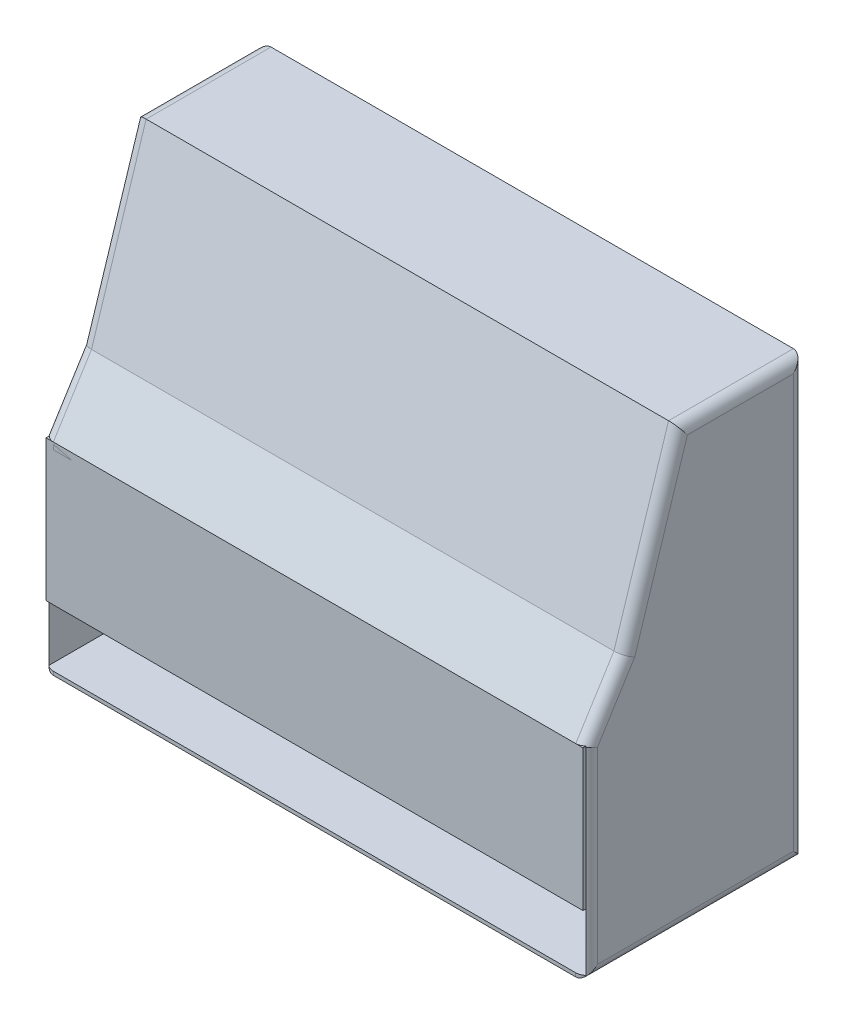
ISO-10303-21;
HEADER;
FILE_DESCRIPTION(('STEP AP214'),'2;1');
FILE_NAME('part.step','',(''),(''),'','','');
FILE_SCHEMA(('AUTOMOTIVE_DESIGN { 1 0 10303 214 1 1 1 1 }'));
ENDSEC;
DATA;
#1=APPLICATION_CONTEXT('core data for automotive mechanical design processes');
#2=APPLICATION_PROTOCOL_DEFINITION('international standard','automotive_design',2000,#1);
#3=PRODUCT_CONTEXT('',#1,'mechanical');
#4=PRODUCT('Part','Part','',(#3));
#5=PRODUCT_RELATED_PRODUCT_CATEGORY('part','',(#4));
#6=PRODUCT_DEFINITION_FORMATION('','',#4);
#7=PRODUCT_DEFINITION_CONTEXT('part definition',#1,'design');
#8=PRODUCT_DEFINITION('design','',#6,#7);
#9=PRODUCT_DEFINITION_SHAPE('','',#8);
#10=(LENGTH_UNIT() NAMED_UNIT(*) SI_UNIT(.MILLI.,.METRE.));
#11=(NAMED_UNIT(*) PLANE_ANGLE_UNIT() SI_UNIT($,.RADIAN.));
#12=(NAMED_UNIT(*) SI_UNIT($,.STERADIAN.) SOLID_ANGLE_UNIT());
#13=UNCERTAINTY_MEASURE_WITH_UNIT(LENGTH_MEASURE(1.E-05),#10,'distance_accuracy_value','');
#14=(GEOMETRIC_REPRESENTATION_CONTEXT(3) GLOBAL_UNCERTAINTY_ASSIGNED_CONTEXT((#13)) GLOBAL_UNIT_ASSIGNED_CONTEXT((#10,
#11,#12)) REPRESENTATION_CONTEXT('',''));
#15=CARTESIAN_POINT('',(0.,0.,0.));
#16=DIRECTION('',(0.,0.,1.));
#17=DIRECTION('',(1.,0.,0.));
#18=AXIS2_PLACEMENT_3D('',#15,#16,#17);
#19=CARTESIAN_POINT('',(1490.,557.142553003162,-10.));
#20=DIRECTION('',(1.,0.,0.));
#21=DIRECTION('',(0.,0.,-1.));
#22=AXIS2_PLACEMENT_3D('',#19,#20,#21);
#23=PLANE('',#22);
#24=DIRECTION('',(0.,1.,0.));
#25=VECTOR('',#24,1.);
#26=CARTESIAN_POINT('',(1490.,557.142553003162,0.));
#27=LINE('',#26,#25);
#28=CARTESIAN_POINT('',(1490.,168.414150606429,0.));
#29=VERTEX_POINT('',#28);
#30=CARTESIAN_POINT('',(1490.,557.142553003162,0.));
#31=VERTEX_POINT('',#30);
#32=EDGE_CURVE('E112',#29,#31,#27,.T.);
#33=ORIENTED_EDGE('',*,*,#32,.F.);
#34=DIRECTION('',(0.,0.,1.));
#35=VECTOR('',#34,1.);
#36=CARTESIAN_POINT('',(1490.,168.414150606429,-10.));
#37=LINE('',#36,#35);
#38=CARTESIAN_POINT('',(1490.,168.414150606429,-10.));
#39=VERTEX_POINT('',#38);
#40=EDGE_CURVE('E12',#39,#29,#37,.T.);
#41=ORIENTED_EDGE('',*,*,#40,.F.);
#42=DIRECTION('',(0.,1.,0.));
#43=VECTOR('',#42,1.);
#44=CARTESIAN_POINT('',(1490.,557.142553003162,-10.));
#45=LINE('',#44,#43);
#46=CARTESIAN_POINT('',(1490.,557.142553003162,-10.));
#47=VERTEX_POINT('',#46);
#48=EDGE_CURVE('E106',#39,#47,#45,.T.);
#49=ORIENTED_EDGE('',*,*,#48,.T.);
#50=DIRECTION('',(0.,0.,1.));
#51=VECTOR('',#50,1.);
#52=CARTESIAN_POINT('',(1490.,557.142553003162,-10.));
#53=LINE('',#52,#51);
#54=EDGE_CURVE('E51',#47,#31,#53,.T.);
#55=ORIENTED_EDGE('',*,*,#54,.T.);
#56=EDGE_LOOP('',(#33,#41,#49,#55));
#57=FACE_BOUND('',#56,.T.);
#58=ADVANCED_FACE('F48',(#57),#23,.T.);
#59=CARTESIAN_POINT('',(1490.,168.414150606429,-10.));
#60=DIRECTION('',(0.,-1.,0.));
#61=DIRECTION('',(0.,0.,-1.));
#62=AXIS2_PLACEMENT_3D('',#59,#60,#61);
#63=PLANE('',#62);
#64=DIRECTION('',(1.,0.,0.));
#65=VECTOR('',#64,1.);
#66=CARTESIAN_POINT('',(1490.,168.414150606429,0.));
#67=LINE('',#66,#65);
#68=CARTESIAN_POINT('',(10.,168.414150606429,0.));
#69=VERTEX_POINT('',#68);
#70=EDGE_CURVE('E108',#69,#29,#67,.T.);
#71=ORIENTED_EDGE('',*,*,#70,.F.);
#72=DIRECTION('',(0.,0.,1.));
#73=VECTOR('',#72,1.);
#74=CARTESIAN_POINT('',(10.,168.414150606429,-10.));
#75=LINE('',#74,#73);
#76=CARTESIAN_POINT('',(10.,168.414150606429,-10.));
#77=VERTEX_POINT('',#76);
#78=EDGE_CURVE('E57',#77,#69,#75,.T.);
#79=ORIENTED_EDGE('',*,*,#78,.F.);
#80=DIRECTION('',(1.,0.,0.));
#81=VECTOR('',#80,1.);
#82=CARTESIAN_POINT('',(1490.,168.414150606429,-10.));
#83=LINE('',#82,#81);
#84=EDGE_CURVE('E103',#77,#39,#83,.T.);
#85=ORIENTED_EDGE('',*,*,#84,.T.);
#86=ORIENTED_EDGE('',*,*,#40,.T.);
#87=EDGE_LOOP('',(#71,#79,#85,#86));
#88=FACE_BOUND('',#87,.T.);
#89=ADVANCED_FACE('F122',(#88),#63,.T.);
#90=CARTESIAN_POINT('',(10.,557.142553003162,-10.));
#91=DIRECTION('',(-1.,0.,0.));
#92=DIRECTION('',(0.,0.,1.));
#93=AXIS2_PLACEMENT_3D('',#90,#91,#92);
#94=PLANE('',#93);
#95=DIRECTION('',(0.,-1.,0.));
#96=VECTOR('',#95,1.);
#97=CARTESIAN_POINT('',(10.,557.142553003162,0.));
#98=LINE('',#97,#96);
#99=CARTESIAN_POINT('',(10.,557.142553003162,0.));
#100=VERTEX_POINT('',#99);
#101=EDGE_CURVE('E98',#100,#69,#98,.T.);
#102=ORIENTED_EDGE('',*,*,#101,.F.);
#103=DIRECTION('',(0.,0.,1.));
#104=VECTOR('',#103,1.);
#105=CARTESIAN_POINT('',(10.,557.142553003162,-10.));
#106=LINE('',#105,#104);
#107=CARTESIAN_POINT('',(10.,557.142553003162,-10.));
#108=VERTEX_POINT('',#107);
#109=EDGE_CURVE('E93',#108,#100,#106,.T.);
#110=ORIENTED_EDGE('',*,*,#109,.F.);
#111=DIRECTION('',(0.,-1.,0.));
#112=VECTOR('',#111,1.);
#113=CARTESIAN_POINT('',(10.,557.142553003162,-10.));
#114=LINE('',#113,#112);
#115=EDGE_CURVE('E96',#108,#77,#114,.T.);
#116=ORIENTED_EDGE('',*,*,#115,.T.);
#117=ORIENTED_EDGE('',*,*,#78,.T.);
#118=EDGE_LOOP('',(#102,#110,#116,#117));
#119=FACE_BOUND('',#118,.T.);
#120=ADVANCED_FACE('F95',(#119),#94,.T.);
#121=CARTESIAN_POINT('',(1490.,557.142553003162,-10.));
#122=DIRECTION('',(0.,1.,0.));
#123=DIRECTION('',(0.,0.,1.));
#124=AXIS2_PLACEMENT_3D('',#121,#122,#123);
#125=PLANE('',#124);
#126=DIRECTION('',(-1.,0.,0.));
#127=VECTOR('',#126,1.);
#128=CARTESIAN_POINT('',(1490.,557.142553003162,0.));
#129=LINE('',#128,#127);
#130=EDGE_CURVE('E115',#31,#100,#129,.T.);
#131=ORIENTED_EDGE('',*,*,#130,.F.);
#132=ORIENTED_EDGE('',*,*,#54,.F.);
#133=DIRECTION('',(-1.,0.,0.));
#134=VECTOR('',#133,1.);
#135=CARTESIAN_POINT('',(1490.,557.142553003162,-10.));
#136=LINE('',#135,#134);
#137=EDGE_CURVE('E102',#47,#108,#136,.T.);
#138=ORIENTED_EDGE('',*,*,#137,.T.);
#139=ORIENTED_EDGE('',*,*,#109,.T.);
#140=EDGE_LOOP('',(#131,#132,#138,#139));
#141=FACE_BOUND('',#140,.T.);
#142=ADVANCED_FACE('F105',(#141),#125,.T.);
#143=CARTESIAN_POINT('',(0.,0.,-10.));
#144=DIRECTION('',(0.,0.,-1.));
#145=DIRECTION('',(-1.,0.,0.));
#146=AXIS2_PLACEMENT_3D('',#143,#144,#145);
#147=PLANE('',#146);
#148=ORIENTED_EDGE('',*,*,#48,.F.);
#149=ORIENTED_EDGE('',*,*,#84,.F.);
#150=ORIENTED_EDGE('',*,*,#115,.F.);
#151=ORIENTED_EDGE('',*,*,#137,.F.);
#152=EDGE_LOOP('',(#148,#149,#150,#151));
#153=FACE_BOUND('',#152,.T.);
#154=ADVANCED_FACE('F101',(#153),#147,.T.);
#155=CARTESIAN_POINT('',(0.,0.,0.));
#156=DIRECTION('',(0.,0.,-1.));
#157=DIRECTION('',(-1.,0.,0.));
#158=AXIS2_PLACEMENT_3D('',#155,#156,#157);
#159=PLANE('',#158);
#160=ORIENTED_EDGE('',*,*,#32,.T.);
#161=ORIENTED_EDGE('',*,*,#130,.T.);
#162=ORIENTED_EDGE('',*,*,#101,.T.);
#163=ORIENTED_EDGE('',*,*,#70,.T.);
#164=EDGE_LOOP('',(#160,#161,#162,#163));
#165=FACE_BOUND('',#164,.T.);
#166=ADVANCED_FACE('F121',(#165),#159,.F.);
#167=CLOSED_SHELL('',(#58,#89,#120,#142,#154,#166));
#168=MANIFOLD_SOLID_BREP('B2',#167);
#169=CARTESIAN_POINT('',(0.,-50.,-600.));
#170=DIRECTION('',(0.,0.,-1.));
#171=DIRECTION('',(-1.,0.,0.));
#172=AXIS2_PLACEMENT_3D('',#169,#170,#171);
#173=PLANE('',#172);
#174=DIRECTION('',(0.,1.,0.));
#175=VECTOR('',#174,1.);
#176=CARTESIAN_POINT('',(1470.,0.,-600.));
#177=LINE('',#176,#175);
#178=CARTESIAN_POINT('',(1470.,1200.,-600.));
#179=VERTEX_POINT('',#178);
#180=CARTESIAN_POINT('',(1470.,0.,-600.));
#181=VERTEX_POINT('',#180);
#182=EDGE_CURVE('E441',#179,#181,#177,.F.);
#183=ORIENTED_EDGE('',*,*,#182,.T.);
#184=DIRECTION('',(-1.,0.,0.));
#185=VECTOR('',#184,1.);
#186=CARTESIAN_POINT('',(0.,0.,-600.));
#187=LINE('',#186,#185);
#188=CARTESIAN_POINT('',(29.9999999999999,0.,-600.));
#189=VERTEX_POINT('',#188);
#190=EDGE_CURVE('E315',#181,#189,#187,.T.);
#191=ORIENTED_EDGE('',*,*,#190,.T.);
#192=DIRECTION('',(0.,1.,0.));
#193=VECTOR('',#192,1.);
#194=CARTESIAN_POINT('',(30.,1200.,-600.));
#195=LINE('',#194,#193);
#196=CARTESIAN_POINT('',(29.9999999999998,1200.,-600.));
#197=VERTEX_POINT('',#196);
#198=EDGE_CURVE('E451',#189,#197,#195,.T.);
#199=ORIENTED_EDGE('',*,*,#198,.T.);
#200=DIRECTION('',(-1.,0.,0.));
#201=VECTOR('',#200,1.);
#202=CARTESIAN_POINT('',(1500.,1200.,-600.));
#203=LINE('',#202,#201);
#204=EDGE_CURVE('E438',#179,#197,#203,.T.);
#205=ORIENTED_EDGE('',*,*,#204,.F.);
#206=EDGE_LOOP('',(#183,#191,#199,#205));
#207=FACE_BOUND('',#206,.T.);
#208=ADVANCED_FACE('F172',(#207),#173,.T.);
#209=CARTESIAN_POINT('',(0.,-50.,0.));
#210=DIRECTION('',(0.,0.,1.));
#211=DIRECTION('',(1.,0.,0.));
#212=AXIS2_PLACEMENT_3D('',#209,#210,#211);
#213=PLANE('',#212);
#214=DIRECTION('',(0.,-1.,0.));
#215=VECTOR('',#214,1.);
#216=CARTESIAN_POINT('',(30.,0.,0.));
#217=LINE('',#216,#215);
#218=CARTESIAN_POINT('',(29.9999999999998,10.,0.));
#219=VERTEX_POINT('',#218);
#220=CARTESIAN_POINT('',(30.,0.,0.));
#221=VERTEX_POINT('',#220);
#222=EDGE_CURVE('E330',#219,#221,#217,.T.);
#223=ORIENTED_EDGE('',*,*,#222,.T.);
#224=DIRECTION('',(1.,0.,0.));
#225=VECTOR('',#224,1.);
#226=CARTESIAN_POINT('',(0.,0.,0.));
#227=LINE('',#226,#225);
#228=CARTESIAN_POINT('',(1470.,0.,0.));
#229=VERTEX_POINT('',#228);
#230=EDGE_CURVE('E312',#221,#229,#227,.T.);
#231=ORIENTED_EDGE('',*,*,#230,.T.);
#232=DIRECTION('',(0.,-1.,0.));
#233=VECTOR('',#232,1.);
#234=CARTESIAN_POINT('',(1470.,0.,0.));
#235=LINE('',#234,#233);
#236=CARTESIAN_POINT('',(1470.,10.,0.));
#237=VERTEX_POINT('',#236);
#238=EDGE_CURVE('E327',#229,#237,#235,.F.);
#239=ORIENTED_EDGE('',*,*,#238,.T.);
#240=DIRECTION('',(-1.,0.,0.));
#241=VECTOR('',#240,1.);
#242=CARTESIAN_POINT('',(1500.,10.,0.));
#243=LINE('',#242,#241);
#244=EDGE_CURVE('E420',#237,#219,#243,.T.);
#245=ORIENTED_EDGE('',*,*,#244,.T.);
#246=EDGE_LOOP('',(#223,#231,#239,#245));
#247=FACE_BOUND('',#246,.T.);
#248=ADVANCED_FACE('F174',(#247),#213,.T.);
#249=CARTESIAN_POINT('',(1500.,0.,0.));
#250=DIRECTION('',(0.,0.,-1.));
#251=DIRECTION('',(-1.,0.,0.));
#252=AXIS2_PLACEMENT_3D('',#249,#250,#251);
#253=PLANE('',#252);
#254=DIRECTION('',(-1.,0.,0.));
#255=VECTOR('',#254,1.);
#256=CARTESIAN_POINT('',(1500.,557.142553003162,0.));
#257=LINE('',#256,#255);
#258=CARTESIAN_POINT('',(1470.,557.142553003162,0.));
#259=VERTEX_POINT('',#258);
#260=CARTESIAN_POINT('',(29.9999999999998,557.142553003162,0.));
#261=VERTEX_POINT('',#260);
#262=EDGE_CURVE('E407',#259,#261,#257,.T.);
#263=ORIENTED_EDGE('',*,*,#262,.T.);
#264=DIRECTION('',(0.,-1.,0.));
#265=VECTOR('',#264,1.);
#266=CARTESIAN_POINT('',(30.,0.,0.));
#267=LINE('',#266,#265);
#268=CARTESIAN_POINT('',(30.,538.275667449797,0.));
#269=VERTEX_POINT('',#268);
#270=EDGE_CURVE('E481',#261,#269,#267,.T.);
#271=ORIENTED_EDGE('',*,*,#270,.T.);
#272=DIRECTION('',(-1.,0.,0.));
#273=VECTOR('',#272,1.);
#274=CARTESIAN_POINT('',(1500.,538.275667449797,0.));
#275=LINE('',#274,#273);
#276=CARTESIAN_POINT('',(1470.,538.275667449797,0.));
#277=VERTEX_POINT('',#276);
#278=EDGE_CURVE('E431',#277,#269,#275,.T.);
#279=ORIENTED_EDGE('',*,*,#278,.F.);
#280=DIRECTION('',(0.,-1.,0.));
#281=VECTOR('',#280,1.);
#282=CARTESIAN_POINT('',(1470.,0.,0.));
#283=LINE('',#282,#281);
#284=EDGE_CURVE('E340',#277,#259,#283,.F.);
#285=ORIENTED_EDGE('',*,*,#284,.T.);
#286=EDGE_LOOP('',(#263,#271,#279,#285));
#287=FACE_BOUND('',#286,.T.);
#288=ADVANCED_FACE('F532',(#287),#253,.F.);
#289=CARTESIAN_POINT('',(1500.,1200.,0.));
#290=DIRECTION('',(0.,-1.,0.));
#291=DIRECTION('',(0.,0.,-1.));
#292=AXIS2_PLACEMENT_3D('',#289,#290,#291);
#293=PLANE('',#292);
#294=ORIENTED_EDGE('',*,*,#204,.T.);
#295=DIRECTION('',(0.,0.,1.));
#296=VECTOR('',#295,1.);
#297=CARTESIAN_POINT('',(30.,1200.,-255.794583458147));
#298=LINE('',#297,#296);
#299=CARTESIAN_POINT('',(29.9999999999998,1200.,-255.794583458147));
#300=VERTEX_POINT('',#299);
#301=EDGE_CURVE('E469',#197,#300,#298,.T.);
#302=ORIENTED_EDGE('',*,*,#301,.T.);
#303=DIRECTION('',(-1.,0.,0.));
#304=VECTOR('',#303,1.);
#305=CARTESIAN_POINT('',(1500.,1200.,-255.794583458147));
#306=LINE('',#305,#304);
#307=CARTESIAN_POINT('',(1470.,1200.,-255.794583458147));
#308=VERTEX_POINT('',#307);
#309=EDGE_CURVE('E442',#308,#300,#306,.T.);
#310=ORIENTED_EDGE('',*,*,#309,.F.);
#311=DIRECTION('',(0.,0.,1.));
#312=VECTOR('',#311,1.);
#313=CARTESIAN_POINT('',(1470.,1200.,0.));
#314=LINE('',#313,#312);
#315=EDGE_CURVE('E467',#308,#179,#314,.F.);
#316=ORIENTED_EDGE('',*,*,#315,.T.);
#317=EDGE_LOOP('',(#294,#302,#310,#316));
#318=FACE_BOUND('',#317,.T.);
#319=ADVANCED_FACE('F539',(#318),#293,.F.);
#320=CARTESIAN_POINT('',(1500.,36.0442867337959,113.580803977429));
#321=DIRECTION('',(0.,-0.302479175503382,-0.953155993731768));
#322=DIRECTION('',(0.,0.953155993731768,-0.302479175503382));
#323=AXIS2_PLACEMENT_3D('',#320,#321,#322);
#324=PLANE('',#323);
#325=ORIENTED_EDGE('',*,*,#309,.T.);
#326=DIRECTION('',(0.,-0.953155993731768,0.302479175503382));
#327=VECTOR('',#326,1.);
#328=CARTESIAN_POINT('',(30.,725.443718948003,-105.196576871037));
#329=LINE('',#328,#327);
#330=CARTESIAN_POINT('',(29.9999999999998,725.443718948003,-105.196576871037));
#331=VERTEX_POINT('',#330);
#332=EDGE_CURVE('E473',#300,#331,#329,.T.);
#333=ORIENTED_EDGE('',*,*,#332,.T.);
#334=DIRECTION('',(-1.,0.,0.));
#335=VECTOR('',#334,1.);
#336=CARTESIAN_POINT('',(1500.,725.443718948003,-105.196576871037));
#337=LINE('',#336,#335);
#338=CARTESIAN_POINT('',(1470.,725.443718948003,-105.196576871037));
#339=VERTEX_POINT('',#338);
#340=EDGE_CURVE('E445',#339,#331,#337,.T.);
#341=ORIENTED_EDGE('',*,*,#340,.F.);
#342=DIRECTION('',(0.,-0.953155993731768,0.302479175503382));
#343=VECTOR('',#342,1.);
#344=CARTESIAN_POINT('',(1470.,36.0442867337959,113.580803977429));
#345=LINE('',#344,#343);
#346=EDGE_CURVE('E471',#339,#308,#345,.F.);
#347=ORIENTED_EDGE('',*,*,#346,.T.);
#348=EDGE_LOOP('',(#325,#333,#341,#347));
#349=FACE_BOUND('',#348,.T.);
#350=ADVANCED_FACE('F510',(#349),#324,.F.);
#351=CARTESIAN_POINT('',(1500.,156.518580265476,250.409854904349));
#352=DIRECTION('',(0.,-0.530029186413129,-0.847979399248729));
#353=DIRECTION('',(0.,0.84797939924873,-0.530029186413129));
#354=AXIS2_PLACEMENT_3D('',#351,#352,#353);
#355=PLANE('',#354);
#356=ORIENTED_EDGE('',*,*,#340,.T.);
#357=DIRECTION('',(0.,-0.84797939924873,0.530029186413129));
#358=VECTOR('',#357,1.);
#359=CARTESIAN_POINT('',(30.,557.142553003162,0.));
#360=LINE('',#359,#358);
#361=EDGE_CURVE('E477',#331,#261,#360,.T.);
#362=ORIENTED_EDGE('',*,*,#361,.T.);
#363=ORIENTED_EDGE('',*,*,#262,.F.);
#364=DIRECTION('',(0.,-0.84797939924873,0.530029186413129));
#365=VECTOR('',#364,1.);
#366=CARTESIAN_POINT('',(1470.,156.518580265476,250.409854904349));
#367=LINE('',#366,#365);
#368=EDGE_CURVE('E475',#259,#339,#367,.F.);
#369=ORIENTED_EDGE('',*,*,#368,.T.);
#370=EDGE_LOOP('',(#356,#362,#363,#369));
#371=FACE_BOUND('',#370,.T.);
#372=ADVANCED_FACE('F507',(#371),#355,.F.);
#373=CARTESIAN_POINT('',(1500.,0.,0.));
#374=DIRECTION('',(-1.,0.,0.));
#375=DIRECTION('',(0.,0.,1.));
#376=AXIS2_PLACEMENT_3D('',#373,#374,#375);
#377=PLANE('',#376);
#378=DIRECTION('',(0.,-0.84797939924873,0.530029186413129));
#379=VECTOR('',#378,1.);
#380=CARTESIAN_POINT('',(1500.,140.617704673082,224.970472926887));
#381=LINE('',#380,#379);
#382=CARTESIAN_POINT('',(1500.,712.756778115355,-132.644827492481));
#383=VERTEX_POINT('',#382);
#384=CARTESIAN_POINT('',(1500.,548.538087174778,-30.));
#385=VERTEX_POINT('',#384);
#386=EDGE_CURVE('E189',#383,#385,#381,.T.);
#387=ORIENTED_EDGE('',*,*,#386,.T.);
#388=DIRECTION('',(0.,-1.,0.));
#389=VECTOR('',#388,1.);
#390=CARTESIAN_POINT('',(1500.,0.,-30.));
#391=LINE('',#390,#389);
#392=CARTESIAN_POINT('',(1500.,30.,-30.));
#393=VERTEX_POINT('',#392);
#394=EDGE_CURVE('E181',#385,#393,#391,.T.);
#395=ORIENTED_EDGE('',*,*,#394,.T.);
#396=DIRECTION('',(0.,0.,-1.));
#397=VECTOR('',#396,1.);
#398=CARTESIAN_POINT('',(1500.,30.,0.));
#399=LINE('',#398,#397);
#400=CARTESIAN_POINT('',(1500.,30.,-570.));
#401=VERTEX_POINT('',#400);
#402=EDGE_CURVE('E343',#393,#401,#399,.T.);
#403=ORIENTED_EDGE('',*,*,#402,.T.);
#404=DIRECTION('',(0.,1.,0.));
#405=VECTOR('',#404,1.);
#406=CARTESIAN_POINT('',(1500.,0.,-570.));
#407=LINE('',#406,#405);
#408=CARTESIAN_POINT('',(1500.,1170.,-570.));
#409=VERTEX_POINT('',#408);
#410=EDGE_CURVE('E493',#401,#409,#407,.T.);
#411=ORIENTED_EDGE('',*,*,#410,.T.);
#412=DIRECTION('',(0.,0.,1.));
#413=VECTOR('',#412,1.);
#414=CARTESIAN_POINT('',(1500.,1170.,0.));
#415=LINE('',#414,#413);
#416=CARTESIAN_POINT('',(1500.,1170.,-277.748623376598));
#417=VERTEX_POINT('',#416);
#418=EDGE_CURVE('E495',#409,#417,#415,.T.);
#419=ORIENTED_EDGE('',*,*,#418,.T.);
#420=DIRECTION('',(0.,-0.953155993731768,0.302479175503382));
#421=VECTOR('',#420,1.);
#422=CARTESIAN_POINT('',(1500.,26.9699114686944,84.9861241654759));
#423=LINE('',#422,#421);
#424=EDGE_CURVE('E194',#417,#383,#423,.T.);
#425=ORIENTED_EDGE('',*,*,#424,.T.);
#426=EDGE_LOOP('',(#387,#395,#403,#411,#419,#425));
#427=FACE_BOUND('',#426,.T.);
#428=ADVANCED_FACE('F498',(#427),#377,.F.);
#429=CARTESIAN_POINT('',(0.,0.,0.));
#430=DIRECTION('',(-1.,0.,0.));
#431=DIRECTION('',(0.,0.,1.));
#432=AXIS2_PLACEMENT_3D('',#429,#430,#431);
#433=PLANE('',#432);
#434=DIRECTION('',(0.,0.,1.));
#435=VECTOR('',#434,1.);
#436=CARTESIAN_POINT('',(0.,1170.,-600.));
#437=LINE('',#436,#435);
#438=CARTESIAN_POINT('',(0.,1170.,-277.748623376598));
#439=VERTEX_POINT('',#438);
#440=CARTESIAN_POINT('',(0.,1170.,-570.));
#441=VERTEX_POINT('',#440);
#442=EDGE_CURVE('E462',#439,#441,#437,.F.);
#443=ORIENTED_EDGE('',*,*,#442,.T.);
#444=DIRECTION('',(0.,1.,0.));
#445=VECTOR('',#444,1.);
#446=CARTESIAN_POINT('',(0.,0.,-570.));
#447=LINE('',#446,#445);
#448=CARTESIAN_POINT('',(0.,30.,-570.));
#449=VERTEX_POINT('',#448);
#450=EDGE_CURVE('E464',#441,#449,#447,.F.);
#451=ORIENTED_EDGE('',*,*,#450,.T.);
#452=DIRECTION('',(0.,0.,-1.));
#453=VECTOR('',#452,1.);
#454=CARTESIAN_POINT('',(0.,30.,0.));
#455=LINE('',#454,#453);
#456=CARTESIAN_POINT('',(0.,30.,-30.));
#457=VERTEX_POINT('',#456);
#458=EDGE_CURVE('E454',#449,#457,#455,.F.);
#459=ORIENTED_EDGE('',*,*,#458,.T.);
#460=DIRECTION('',(0.,-1.,0.));
#461=VECTOR('',#460,1.);
#462=CARTESIAN_POINT('',(0.,557.142553003162,-30.));
#463=LINE('',#462,#461);
#464=CARTESIAN_POINT('',(0.,548.538087174778,-30.));
#465=VERTEX_POINT('',#464);
#466=EDGE_CURVE('E456',#457,#465,#463,.F.);
#467=ORIENTED_EDGE('',*,*,#466,.T.);
#468=DIRECTION('',(0.,-0.84797939924873,0.530029186413129));
#469=VECTOR('',#468,1.);
#470=CARTESIAN_POINT('',(0.,709.542843355609,-130.635958848499));
#471=LINE('',#470,#469);
#472=CARTESIAN_POINT('',(0.,712.756778115355,-132.644827492481));
#473=VERTEX_POINT('',#472);
#474=EDGE_CURVE('E458',#465,#473,#471,.F.);
#475=ORIENTED_EDGE('',*,*,#474,.T.);
#476=DIRECTION('',(0.,-0.953155993731768,0.302479175503382));
#477=VECTOR('',#476,1.);
#478=CARTESIAN_POINT('',(0.,1190.9256247349,-284.3892632701));
#479=LINE('',#478,#477);
#480=EDGE_CURVE('E460',#473,#439,#479,.F.);
#481=ORIENTED_EDGE('',*,*,#480,.T.);
#482=EDGE_LOOP('',(#443,#451,#459,#467,#475,#481));
#483=FACE_BOUND('',#482,.T.);
#484=ADVANCED_FACE('F546',(#483),#433,.T.);
#485=CARTESIAN_POINT('',(1500.,10.,0.));
#486=DIRECTION('',(0.,1.,0.));
#487=DIRECTION('',(0.,0.,1.));
#488=AXIS2_PLACEMENT_3D('',#485,#486,#487);
#489=PLANE('',#488);
#490=DIRECTION('',(0.,0.,-1.));
#491=VECTOR('',#490,1.);
#492=CARTESIAN_POINT('',(10.,10.,0.));
#493=LINE('',#492,#491);
#494=CARTESIAN_POINT('',(10.,10.,-7.63932022500213));
#495=VERTEX_POINT('',#494);
#496=CARTESIAN_POINT('',(10.,10.,-590.));
#497=VERTEX_POINT('',#496);
#498=EDGE_CURVE('E389',#495,#497,#493,.T.);
#499=ORIENTED_EDGE('',*,*,#498,.F.);
#500=CARTESIAN_POINT('',(30.,10.,-30.));
#501=DIRECTION('',(0.,1.,0.));
#502=DIRECTION('',(0.,0.,1.));
#503=AXIS2_PLACEMENT_3D('',#500,#501,#502);
#504=CIRCLE('',#503,30.);
#505=EDGE_CURVE('E321',#495,#219,#504,.T.);
#506=ORIENTED_EDGE('',*,*,#505,.T.);
#507=ORIENTED_EDGE('',*,*,#244,.F.);
#508=CARTESIAN_POINT('',(1470.,10.,-30.));
#509=DIRECTION('',(0.,1.,0.));
#510=DIRECTION('',(0.,0.,1.));
#511=AXIS2_PLACEMENT_3D('',#508,#509,#510);
#512=CIRCLE('',#511,30.);
#513=CARTESIAN_POINT('',(1490.,10.,-7.63932022500215));
#514=VERTEX_POINT('',#513);
#515=EDGE_CURVE('E339',#237,#514,#512,.T.);
#516=ORIENTED_EDGE('',*,*,#515,.T.);
#517=DIRECTION('',(0.,0.,-1.));
#518=VECTOR('',#517,1.);
#519=CARTESIAN_POINT('',(1490.,10.,0.));
#520=LINE('',#519,#518);
#521=CARTESIAN_POINT('',(1490.,10.,-590.));
#522=VERTEX_POINT('',#521);
#523=EDGE_CURVE('E409',#514,#522,#520,.T.);
#524=ORIENTED_EDGE('',*,*,#523,.T.);
#525=DIRECTION('',(-1.,0.,0.));
#526=VECTOR('',#525,1.);
#527=CARTESIAN_POINT('',(1500.,10.,-590.));
#528=LINE('',#527,#526);
#529=EDGE_CURVE('E404',#522,#497,#528,.T.);
#530=ORIENTED_EDGE('',*,*,#529,.T.);
#531=EDGE_LOOP('',(#499,#506,#507,#516,#524,#530));
#532=FACE_BOUND('',#531,.T.);
#533=ADVANCED_FACE('F557',(#532),#489,.T.);
#534=CARTESIAN_POINT('',(1500.,0.,-590.));
#535=DIRECTION('',(0.,0.,1.));
#536=DIRECTION('',(1.,0.,0.));
#537=AXIS2_PLACEMENT_3D('',#534,#535,#536);
#538=PLANE('',#537);
#539=DIRECTION('',(0.,1.,0.));
#540=VECTOR('',#539,1.);
#541=CARTESIAN_POINT('',(10.,0.,-590.));
#542=LINE('',#541,#540);
#543=CARTESIAN_POINT('',(10.,1190.,-590.));
#544=VERTEX_POINT('',#543);
#545=EDGE_CURVE('E412',#497,#544,#542,.T.);
#546=ORIENTED_EDGE('',*,*,#545,.F.);
#547=ORIENTED_EDGE('',*,*,#529,.F.);
#548=DIRECTION('',(0.,1.,0.));
#549=VECTOR('',#548,1.);
#550=CARTESIAN_POINT('',(1490.,0.,-590.));
#551=LINE('',#550,#549);
#552=CARTESIAN_POINT('',(1490.,1190.,-590.));
#553=VERTEX_POINT('',#552);
#554=EDGE_CURVE('E418',#522,#553,#551,.T.);
#555=ORIENTED_EDGE('',*,*,#554,.T.);
#556=DIRECTION('',(-1.,0.,0.));
#557=VECTOR('',#556,1.);
#558=CARTESIAN_POINT('',(1500.,1190.,-590.));
#559=LINE('',#558,#557);
#560=EDGE_CURVE('E408',#553,#544,#559,.T.);
#561=ORIENTED_EDGE('',*,*,#560,.T.);
#562=EDGE_LOOP('',(#546,#547,#555,#561));
#563=FACE_BOUND('',#562,.T.);
#564=ADVANCED_FACE('F562',(#563),#538,.T.);
#565=CARTESIAN_POINT('',(1500.,1190.,0.));
#566=DIRECTION('',(0.,-1.,0.));
#567=DIRECTION('',(0.,0.,-1.));
#568=AXIS2_PLACEMENT_3D('',#565,#566,#567);
#569=PLANE('',#568);
#570=DIRECTION('',(0.,0.,1.));
#571=VECTOR('',#570,1.);
#572=CARTESIAN_POINT('',(10.,1190.,0.));
#573=LINE('',#572,#571);
#574=CARTESIAN_POINT('',(10.,1190.,-263.112596764297));
#575=VERTEX_POINT('',#574);
#576=EDGE_CURVE('E414',#544,#575,#573,.T.);
#577=ORIENTED_EDGE('',*,*,#576,.F.);
#578=ORIENTED_EDGE('',*,*,#560,.F.);
#579=DIRECTION('',(0.,0.,1.));
#580=VECTOR('',#579,1.);
#581=CARTESIAN_POINT('',(1490.,1190.,0.));
#582=LINE('',#581,#580);
#583=CARTESIAN_POINT('',(1490.,1190.,-263.112596764297));
#584=VERTEX_POINT('',#583);
#585=EDGE_CURVE('E421',#553,#584,#582,.T.);
#586=ORIENTED_EDGE('',*,*,#585,.T.);
#587=DIRECTION('',(-1.,0.,0.));
#588=VECTOR('',#587,1.);
#589=CARTESIAN_POINT('',(1500.,1190.,-263.112596764297));
#590=LINE('',#589,#588);
#591=EDGE_CURVE('E417',#584,#575,#590,.T.);
#592=ORIENTED_EDGE('',*,*,#591,.T.);
#593=EDGE_LOOP('',(#577,#578,#586,#592));
#594=FACE_BOUND('',#593,.T.);
#595=ADVANCED_FACE('F569',(#594),#569,.T.);
#596=CARTESIAN_POINT('',(1500.,33.019494978762,104.049244040111));
#597=DIRECTION('',(0.,-0.302479175503382,-0.953155993731768));
#598=DIRECTION('',(0.,0.953155993731768,-0.302479175503382));
#599=AXIS2_PLACEMENT_3D('',#596,#597,#598);
#600=PLANE('',#599);
#601=DIRECTION('',(0.,-0.953155993731768,0.302479175503382));
#602=VECTOR('',#601,1.);
#603=CARTESIAN_POINT('',(10.,33.019494978762,104.049244040111));
#604=LINE('',#603,#602);
#605=CARTESIAN_POINT('',(10.,721.214738670454,-114.345993744852));
#606=VERTEX_POINT('',#605);
#607=EDGE_CURVE('E400',#575,#606,#604,.T.);
#608=ORIENTED_EDGE('',*,*,#607,.F.);
#609=ORIENTED_EDGE('',*,*,#591,.F.);
#610=DIRECTION('',(0.,-0.953155993731768,0.302479175503382));
#611=VECTOR('',#610,1.);
#612=CARTESIAN_POINT('',(1490.,33.019494978762,104.049244040111));
#613=LINE('',#612,#611);
#614=CARTESIAN_POINT('',(1490.,721.214738670454,-114.345993744852));
#615=VERTEX_POINT('',#614);
#616=EDGE_CURVE('E427',#584,#615,#613,.T.);
#617=ORIENTED_EDGE('',*,*,#616,.T.);
#618=DIRECTION('',(-1.,0.,0.));
#619=VECTOR('',#618,1.);
#620=CARTESIAN_POINT('',(1500.,721.214738670453,-114.345993744852));
#621=LINE('',#620,#619);
#622=EDGE_CURVE('E425',#615,#606,#621,.T.);
#623=ORIENTED_EDGE('',*,*,#622,.T.);
#624=EDGE_LOOP('',(#608,#609,#617,#623));
#625=FACE_BOUND('',#624,.T.);
#626=ADVANCED_FACE('F573',(#625),#600,.T.);
#627=CARTESIAN_POINT('',(1500.,151.218288401344,241.930060911862));
#628=DIRECTION('',(0.,-0.530029186413129,-0.847979399248729));
#629=DIRECTION('',(0.,0.84797939924873,-0.530029186413129));
#630=AXIS2_PLACEMENT_3D('',#627,#628,#629);
#631=PLANE('',#630);
#632=ORIENTED_EDGE('',*,*,#278,.T.);
#633=CARTESIAN_POINT('',(30.,586.271858281509,-30.));
#634=DIRECTION('',(0.,-0.530029186413129,-0.847979399248729));
#635=DIRECTION('',(0.,0.84797939924873,-0.530029186413129));
#636=AXIS2_PLACEMENT_3D('',#633,#634,#635);
#637=ELLIPSE('',#636,56.6006566600969,30.);
#638=CARTESIAN_POINT('',(10.,550.497609827922,-7.63932022500217));
#639=VERTEX_POINT('',#638);
#640=EDGE_CURVE('E485',#269,#639,#637,.T.);
#641=ORIENTED_EDGE('',*,*,#640,.T.);
#642=DIRECTION('',(0.,-0.84797939924873,0.530029186413129));
#643=VECTOR('',#642,1.);
#644=CARTESIAN_POINT('',(10.,151.218288401344,241.930060911862));
#645=LINE('',#644,#643);
#646=EDGE_CURVE('E394',#606,#639,#645,.T.);
#647=ORIENTED_EDGE('',*,*,#646,.F.);
#648=ORIENTED_EDGE('',*,*,#622,.F.);
#649=DIRECTION('',(0.,-0.84797939924873,0.530029186413129));
#650=VECTOR('',#649,1.);
#651=CARTESIAN_POINT('',(1490.,151.218288401344,241.930060911862));
#652=LINE('',#651,#650);
#653=CARTESIAN_POINT('',(1490.,550.497609827922,-7.63932022500216));
#654=VERTEX_POINT('',#653);
#655=EDGE_CURVE('E411',#615,#654,#652,.T.);
#656=ORIENTED_EDGE('',*,*,#655,.T.);
#657=CARTESIAN_POINT('',(1470.,586.271858281509,-30.));
#658=DIRECTION('',(0.,-0.530029186413129,-0.847979399248729));
#659=DIRECTION('',(0.,-0.84797939924873,0.530029186413129));
#660=AXIS2_PLACEMENT_3D('',#657,#658,#659);
#661=ELLIPSE('',#660,56.6006566600969,30.);
#662=EDGE_CURVE('E483',#654,#277,#661,.T.);
#663=ORIENTED_EDGE('',*,*,#662,.T.);
#664=EDGE_LOOP('',(#632,#641,#647,#648,#656,#663));
#665=FACE_BOUND('',#664,.T.);
#666=ADVANCED_FACE('F578',(#665),#631,.T.);
#667=CARTESIAN_POINT('',(1490.,0.,0.));
#668=DIRECTION('',(-1.,0.,0.));
#669=DIRECTION('',(0.,0.,1.));
#670=AXIS2_PLACEMENT_3D('',#667,#668,#669);
#671=PLANE('',#670);
#672=ORIENTED_EDGE('',*,*,#523,.F.);
#673=DIRECTION('',(0.,-1.,0.));
#674=VECTOR('',#673,1.);
#675=CARTESIAN_POINT('',(1490.,10.,-7.63932022500212));
#676=LINE('',#675,#674);
#677=EDGE_CURVE('E46',#514,#654,#676,.F.);
#678=ORIENTED_EDGE('',*,*,#677,.T.);
#679=ORIENTED_EDGE('',*,*,#655,.F.);
#680=ORIENTED_EDGE('',*,*,#616,.F.);
#681=ORIENTED_EDGE('',*,*,#585,.F.);
#682=ORIENTED_EDGE('',*,*,#554,.F.);
#683=EDGE_LOOP('',(#672,#678,#679,#680,#681,#682));
#684=FACE_BOUND('',#683,.T.);
#685=ADVANCED_FACE('F591',(#684),#671,.T.);
#686=CARTESIAN_POINT('',(10.,0.,0.));
#687=DIRECTION('',(-1.,0.,0.));
#688=DIRECTION('',(0.,0.,1.));
#689=AXIS2_PLACEMENT_3D('',#686,#687,#688);
#690=PLANE('',#689);
#691=ORIENTED_EDGE('',*,*,#646,.T.);
#692=DIRECTION('',(0.,1.,0.));
#693=VECTOR('',#692,1.);
#694=CARTESIAN_POINT('',(10.,550.497609827922,-7.63932022500218));
#695=LINE('',#694,#693);
#696=EDGE_CURVE('E487',#639,#495,#695,.F.);
#697=ORIENTED_EDGE('',*,*,#696,.T.);
#698=ORIENTED_EDGE('',*,*,#498,.T.);
#699=ORIENTED_EDGE('',*,*,#545,.T.);
#700=ORIENTED_EDGE('',*,*,#576,.T.);
#701=ORIENTED_EDGE('',*,*,#607,.T.);
#702=EDGE_LOOP('',(#691,#697,#698,#699,#700,#701));
#703=FACE_BOUND('',#702,.T.);
#704=ADVANCED_FACE('F565',(#703),#690,.F.);
#705=CARTESIAN_POINT('',(30.,140.617704673082,224.970472926887));
#706=DIRECTION('',(0.,0.84797939924873,-0.530029186413129));
#707=DIRECTION('',(0.,0.530029186413129,0.84797939924873));
#708=AXIS2_PLACEMENT_3D('',#705,#706,#707);
#709=CYLINDRICAL_SURFACE('',#708,30.);
#710=CARTESIAN_POINT('',(30.,712.756778115355,-132.644827492481));
#711=DIRECTION('',(0.,0.907726240574772,-0.419562953764975));
#712=DIRECTION('',(0.,0.419562953764975,0.907726240574772));
#713=AXIS2_PLACEMENT_3D('',#710,#711,#712);
#714=ELLIPSE('',#713,30.2384677169442,30.);
#715=EDGE_CURVE('E382',#473,#331,#714,.T.);
#716=ORIENTED_EDGE('',*,*,#715,.F.);
#717=ORIENTED_EDGE('',*,*,#474,.F.);
#718=CARTESIAN_POINT('',(30.,548.538087174778,-30.));
#719=DIRECTION('',(0.,0.9612438294337,-0.275699656103585));
#720=DIRECTION('',(0.,0.275699656103585,0.9612438294337));
#721=AXIS2_PLACEMENT_3D('',#718,#719,#720);
#722=ELLIPSE('',#721,31.2095631528516,30.);
#723=EDGE_CURVE('E350',#261,#465,#722,.F.);
#724=ORIENTED_EDGE('',*,*,#723,.F.);
#725=ORIENTED_EDGE('',*,*,#361,.F.);
#726=EDGE_LOOP('',(#716,#717,#724,#725));
#727=FACE_BOUND('',#726,.T.);
#728=ADVANCED_FACE('F582',(#727),#709,.T.);
#729=CARTESIAN_POINT('',(30.,0.,-30.));
#730=DIRECTION('',(0.,1.,0.));
#731=DIRECTION('',(0.,0.,1.));
#732=AXIS2_PLACEMENT_3D('',#729,#730,#731);
#733=CYLINDRICAL_SURFACE('',#732,30.);
#734=ORIENTED_EDGE('',*,*,#723,.T.);
#735=ORIENTED_EDGE('',*,*,#466,.F.);
#736=CARTESIAN_POINT('',(30.,30.,-30.));
#737=DIRECTION('',(0.,0.707106781186547,0.707106781186547));
#738=DIRECTION('',(0.,-0.707106781186547,0.707106781186547));
#739=AXIS2_PLACEMENT_3D('',#736,#737,#738);
#740=ELLIPSE('',#739,42.4264068711928,30.);
#741=EDGE_CURVE('E380',#221,#457,#740,.F.);
#742=ORIENTED_EDGE('',*,*,#741,.F.);
#743=ORIENTED_EDGE('',*,*,#222,.F.);
#744=ORIENTED_EDGE('',*,*,#505,.F.);
#745=ORIENTED_EDGE('',*,*,#696,.F.);
#746=ORIENTED_EDGE('',*,*,#640,.F.);
#747=ORIENTED_EDGE('',*,*,#270,.F.);
#748=EDGE_LOOP('',(#734,#735,#742,#743,#744,#745,#746,#747));
#749=FACE_BOUND('',#748,.T.);
#750=ADVANCED_FACE('F552',(#749),#733,.T.);
#751=CARTESIAN_POINT('',(30.,26.9699114686944,84.9861241654759));
#752=DIRECTION('',(0.,0.953155993731768,-0.302479175503382));
#753=DIRECTION('',(0.,0.302479175503382,0.953155993731768));
#754=AXIS2_PLACEMENT_3D('',#751,#752,#753);
#755=CYLINDRICAL_SURFACE('',#754,30.);
#756=ORIENTED_EDGE('',*,*,#715,.T.);
#757=ORIENTED_EDGE('',*,*,#332,.F.);
#758=CARTESIAN_POINT('',(30.,1170.,-277.748623376598));
#759=DIRECTION('',(0.,0.59055940619747,-0.806994168350485));
#760=DIRECTION('',(0.,0.806994168350485,0.59055940619747));
#761=AXIS2_PLACEMENT_3D('',#758,#759,#760);
#762=ELLIPSE('',#761,37.1749898283908,30.);
#763=EDGE_CURVE('E374',#439,#300,#762,.T.);
#764=ORIENTED_EDGE('',*,*,#763,.F.);
#765=ORIENTED_EDGE('',*,*,#480,.F.);
#766=EDGE_LOOP('',(#756,#757,#764,#765));
#767=FACE_BOUND('',#766,.T.);
#768=ADVANCED_FACE('F541',(#767),#755,.T.);
#769=CARTESIAN_POINT('',(30.,30.,0.));
#770=DIRECTION('',(0.,0.,1.));
#771=DIRECTION('',(1.,0.,0.));
#772=AXIS2_PLACEMENT_3D('',#769,#770,#771);
#773=CYLINDRICAL_SURFACE('',#772,30.);
#774=ORIENTED_EDGE('',*,*,#741,.T.);
#775=ORIENTED_EDGE('',*,*,#458,.F.);
#776=CARTESIAN_POINT('',(30.,30.,-570.));
#777=DIRECTION('',(0.,-0.707106781186547,0.707106781186547));
#778=DIRECTION('',(0.,0.707106781186547,0.707106781186547));
#779=AXIS2_PLACEMENT_3D('',#776,#777,#778);
#780=ELLIPSE('',#779,42.4264068711928,30.);
#781=EDGE_CURVE('E367',#189,#449,#780,.F.);
#782=ORIENTED_EDGE('',*,*,#781,.F.);
#783=DIRECTION('',(0.,0.,-1.));
#784=VECTOR('',#783,1.);
#785=CARTESIAN_POINT('',(30.,0.,-600.));
#786=LINE('',#785,#784);
#787=EDGE_CURVE('E320',#221,#189,#786,.T.);
#788=ORIENTED_EDGE('',*,*,#787,.F.);
#789=EDGE_LOOP('',(#774,#775,#782,#788));
#790=FACE_BOUND('',#789,.T.);
#791=ADVANCED_FACE('F550',(#790),#773,.T.);
#792=CARTESIAN_POINT('',(30.,1170.,0.));
#793=DIRECTION('',(0.,0.,-1.));
#794=DIRECTION('',(-1.,0.,0.));
#795=AXIS2_PLACEMENT_3D('',#792,#793,#794);
#796=CYLINDRICAL_SURFACE('',#795,30.);
#797=ORIENTED_EDGE('',*,*,#763,.T.);
#798=ORIENTED_EDGE('',*,*,#301,.F.);
#799=CARTESIAN_POINT('',(30.,1170.,-570.));
#800=DIRECTION('',(0.,-0.707106781186547,-0.707106781186547));
#801=DIRECTION('',(0.,0.707106781186547,-0.707106781186547));
#802=AXIS2_PLACEMENT_3D('',#799,#800,#801);
#803=ELLIPSE('',#802,42.4264068711928,30.);
#804=EDGE_CURVE('E363',#441,#197,#803,.T.);
#805=ORIENTED_EDGE('',*,*,#804,.F.);
#806=ORIENTED_EDGE('',*,*,#442,.F.);
#807=EDGE_LOOP('',(#797,#798,#805,#806));
#808=FACE_BOUND('',#807,.T.);
#809=ADVANCED_FACE('F544',(#808),#796,.T.);
#810=CARTESIAN_POINT('',(30.,0.,-570.));
#811=DIRECTION('',(0.,-1.,0.));
#812=DIRECTION('',(0.,0.,-1.));
#813=AXIS2_PLACEMENT_3D('',#810,#811,#812);
#814=CYLINDRICAL_SURFACE('',#813,30.);
#815=ORIENTED_EDGE('',*,*,#781,.T.);
#816=ORIENTED_EDGE('',*,*,#450,.F.);
#817=ORIENTED_EDGE('',*,*,#804,.T.);
#818=ORIENTED_EDGE('',*,*,#198,.F.);
#819=EDGE_LOOP('',(#815,#816,#817,#818));
#820=FACE_BOUND('',#819,.T.);
#821=ADVANCED_FACE('F523',(#820),#814,.T.);
#822=CARTESIAN_POINT('',(1470.,1170.,0.));
#823=DIRECTION('',(0.,0.,1.));
#824=DIRECTION('',(1.,0.,0.));
#825=AXIS2_PLACEMENT_3D('',#822,#823,#824);
#826=CYLINDRICAL_SURFACE('',#825,30.);
#827=CARTESIAN_POINT('',(1470.,1170.,-570.));
#828=DIRECTION('',(0.,0.707106781186547,0.707106781186547));
#829=DIRECTION('',(0.,0.707106781186547,-0.707106781186547));
#830=AXIS2_PLACEMENT_3D('',#827,#828,#829);
#831=ELLIPSE('',#830,42.4264068711928,30.);
#832=EDGE_CURVE('E356',#179,#409,#831,.F.);
#833=ORIENTED_EDGE('',*,*,#832,.F.);
#834=ORIENTED_EDGE('',*,*,#315,.F.);
#835=CARTESIAN_POINT('',(1470.,1170.,-277.748623376598));
#836=DIRECTION('',(0.,-0.59055940619747,0.806994168350485));
#837=DIRECTION('',(0.,0.806994168350485,0.59055940619747));
#838=AXIS2_PLACEMENT_3D('',#835,#836,#837);
#839=ELLIPSE('',#838,37.1749898283908,30.);
#840=EDGE_CURVE('E176',#417,#308,#839,.T.);
#841=ORIENTED_EDGE('',*,*,#840,.F.);
#842=ORIENTED_EDGE('',*,*,#418,.F.);
#843=EDGE_LOOP('',(#833,#834,#841,#842));
#844=FACE_BOUND('',#843,.T.);
#845=ADVANCED_FACE('F515',(#844),#826,.T.);
#846=CARTESIAN_POINT('',(1470.,26.9699114686944,84.9861241654759));
#847=DIRECTION('',(0.,-0.953155993731768,0.302479175503382));
#848=DIRECTION('',(0.,-0.302479175503382,-0.953155993731768));
#849=AXIS2_PLACEMENT_3D('',#846,#847,#848);
#850=CYLINDRICAL_SURFACE('',#849,30.);
#851=ORIENTED_EDGE('',*,*,#840,.T.);
#852=ORIENTED_EDGE('',*,*,#346,.F.);
#853=CARTESIAN_POINT('',(1470.,712.756778115355,-132.644827492481));
#854=DIRECTION('',(0.,-0.907726240574772,0.419562953764975));
#855=DIRECTION('',(0.,0.419562953764975,0.907726240574772));
#856=AXIS2_PLACEMENT_3D('',#853,#854,#855);
#857=ELLIPSE('',#856,30.2384677169442,30.);
#858=EDGE_CURVE('E354',#383,#339,#857,.T.);
#859=ORIENTED_EDGE('',*,*,#858,.F.);
#860=ORIENTED_EDGE('',*,*,#424,.F.);
#861=EDGE_LOOP('',(#851,#852,#859,#860));
#862=FACE_BOUND('',#861,.T.);
#863=ADVANCED_FACE('F512',(#862),#850,.T.);
#864=CARTESIAN_POINT('',(1470.,0.,-570.));
#865=DIRECTION('',(0.,1.,0.));
#866=DIRECTION('',(0.,0.,1.));
#867=AXIS2_PLACEMENT_3D('',#864,#865,#866);
#868=CYLINDRICAL_SURFACE('',#867,30.);
#869=ORIENTED_EDGE('',*,*,#832,.T.);
#870=ORIENTED_EDGE('',*,*,#410,.F.);
#871=CARTESIAN_POINT('',(1470.,30.,-570.));
#872=DIRECTION('',(0.,0.707106781186547,-0.707106781186547));
#873=DIRECTION('',(0.,-0.707106781186547,-0.707106781186547));
#874=AXIS2_PLACEMENT_3D('',#871,#872,#873);
#875=ELLIPSE('',#874,42.4264068711928,30.);
#876=EDGE_CURVE('E347',#181,#401,#875,.F.);
#877=ORIENTED_EDGE('',*,*,#876,.F.);
#878=ORIENTED_EDGE('',*,*,#182,.F.);
#879=EDGE_LOOP('',(#869,#870,#877,#878));
#880=FACE_BOUND('',#879,.T.);
#881=ADVANCED_FACE('F514',(#880),#868,.T.);
#882=CARTESIAN_POINT('',(1470.,140.617704673082,224.970472926887));
#883=DIRECTION('',(0.,-0.84797939924873,0.530029186413129));
#884=DIRECTION('',(0.,-0.530029186413129,-0.84797939924873));
#885=AXIS2_PLACEMENT_3D('',#882,#883,#884);
#886=CYLINDRICAL_SURFACE('',#885,30.);
#887=ORIENTED_EDGE('',*,*,#858,.T.);
#888=ORIENTED_EDGE('',*,*,#368,.F.);
#889=CARTESIAN_POINT('',(1470.,548.538087174778,-30.));
#890=DIRECTION('',(0.,-0.9612438294337,0.275699656103585));
#891=DIRECTION('',(0.,0.275699656103585,0.9612438294337));
#892=AXIS2_PLACEMENT_3D('',#889,#890,#891);
#893=ELLIPSE('',#892,31.2095631528516,30.);
#894=EDGE_CURVE('E344',#385,#259,#893,.T.);
#895=ORIENTED_EDGE('',*,*,#894,.F.);
#896=ORIENTED_EDGE('',*,*,#386,.F.);
#897=EDGE_LOOP('',(#887,#888,#895,#896));
#898=FACE_BOUND('',#897,.T.);
#899=ADVANCED_FACE('F503',(#898),#886,.T.);
#900=CARTESIAN_POINT('',(1470.,30.,0.));
#901=DIRECTION('',(0.,0.,-1.));
#902=DIRECTION('',(-1.,0.,0.));
#903=AXIS2_PLACEMENT_3D('',#900,#901,#902);
#904=CYLINDRICAL_SURFACE('',#903,30.);
#905=ORIENTED_EDGE('',*,*,#876,.T.);
#906=ORIENTED_EDGE('',*,*,#402,.F.);
#907=CARTESIAN_POINT('',(1470.,30.,-30.));
#908=DIRECTION('',(0.,-0.707106781186547,-0.707106781186547));
#909=DIRECTION('',(0.,0.707106781186547,-0.707106781186547));
#910=AXIS2_PLACEMENT_3D('',#907,#908,#909);
#911=ELLIPSE('',#910,42.4264068711928,30.);
#912=EDGE_CURVE('E332',#229,#393,#911,.F.);
#913=ORIENTED_EDGE('',*,*,#912,.F.);
#914=DIRECTION('',(0.,0.,-1.));
#915=VECTOR('',#914,1.);
#916=CARTESIAN_POINT('',(1470.,0.,0.));
#917=LINE('',#916,#915);
#918=EDGE_CURVE('E309',#181,#229,#917,.F.);
#919=ORIENTED_EDGE('',*,*,#918,.F.);
#920=EDGE_LOOP('',(#905,#906,#913,#919));
#921=FACE_BOUND('',#920,.T.);
#922=ADVANCED_FACE('F342',(#921),#904,.T.);
#923=CARTESIAN_POINT('',(1470.,0.,-30.));
#924=DIRECTION('',(0.,-1.,0.));
#925=DIRECTION('',(0.,0.,-1.));
#926=AXIS2_PLACEMENT_3D('',#923,#924,#925);
#927=CYLINDRICAL_SURFACE('',#926,30.);
#928=ORIENTED_EDGE('',*,*,#515,.F.);
#929=ORIENTED_EDGE('',*,*,#238,.F.);
#930=ORIENTED_EDGE('',*,*,#912,.T.);
#931=ORIENTED_EDGE('',*,*,#394,.F.);
#932=ORIENTED_EDGE('',*,*,#894,.T.);
#933=ORIENTED_EDGE('',*,*,#284,.F.);
#934=ORIENTED_EDGE('',*,*,#662,.F.);
#935=ORIENTED_EDGE('',*,*,#677,.F.);
#936=EDGE_LOOP('',(#928,#929,#930,#931,#932,#933,#934,#935));
#937=FACE_BOUND('',#936,.T.);
#938=ADVANCED_FACE('F335',(#937),#927,.T.);
#939=CARTESIAN_POINT('',(1500.,0.,20000.));
#940=DIRECTION('',(0.,-1.,0.));
#941=DIRECTION('',(0.,0.,-1.));
#942=AXIS2_PLACEMENT_3D('',#939,#940,#941);
#943=PLANE('',#942);
#944=ORIENTED_EDGE('',*,*,#787,.T.);
#945=ORIENTED_EDGE('',*,*,#190,.F.);
#946=ORIENTED_EDGE('',*,*,#918,.T.);
#947=ORIENTED_EDGE('',*,*,#230,.F.);
#948=EDGE_LOOP('',(#944,#945,#946,#947));
#949=FACE_BOUND('',#948,.T.);
#950=ADVANCED_FACE('F311',(#949),#943,.T.);
#951=CLOSED_SHELL('',(#208,#248,#288,#319,#350,#372,#428,#484,#533,#564,#595,#626,#666,#685,
#704,#728,#750,#768,#791,#809,#821,#845,#863,#881,#899,#922,#938,#950));
#952=MANIFOLD_SOLID_BREP('B6',#951);
#953=ADVANCED_BREP_SHAPE_REPRESENTATION('',(#18,#168,#952),#14);
#954=SHAPE_DEFINITION_REPRESENTATION(#9,#953);
ENDSEC;
END-ISO-10303-21;
